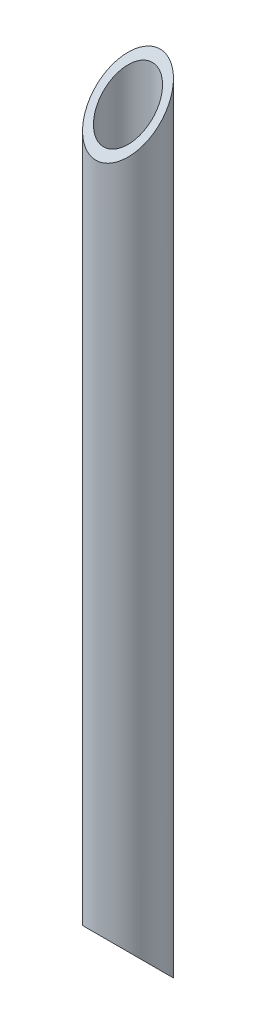
ISO-10303-21;
HEADER;
FILE_DESCRIPTION(('STEP AP214'),'2;1');
FILE_NAME('part.step','',(''),(''),'','','');
FILE_SCHEMA(('AUTOMOTIVE_DESIGN { 1 0 10303 214 1 1 1 1 }'));
ENDSEC;
DATA;
#1=APPLICATION_CONTEXT('core data for automotive mechanical design processes');
#2=APPLICATION_PROTOCOL_DEFINITION('international standard','automotive_design',2000,#1);
#3=PRODUCT_CONTEXT('',#1,'mechanical');
#4=PRODUCT('Part','Part','',(#3));
#5=PRODUCT_RELATED_PRODUCT_CATEGORY('part','',(#4));
#6=PRODUCT_DEFINITION_FORMATION('','',#4);
#7=PRODUCT_DEFINITION_CONTEXT('part definition',#1,'design');
#8=PRODUCT_DEFINITION('design','',#6,#7);
#9=PRODUCT_DEFINITION_SHAPE('','',#8);
#10=(LENGTH_UNIT() NAMED_UNIT(*) SI_UNIT(.MILLI.,.METRE.));
#11=(NAMED_UNIT(*) PLANE_ANGLE_UNIT() SI_UNIT($,.RADIAN.));
#12=(NAMED_UNIT(*) SI_UNIT($,.STERADIAN.) SOLID_ANGLE_UNIT());
#13=UNCERTAINTY_MEASURE_WITH_UNIT(LENGTH_MEASURE(1.E-05),#10,'distance_accuracy_value','');
#14=(GEOMETRIC_REPRESENTATION_CONTEXT(3) GLOBAL_UNCERTAINTY_ASSIGNED_CONTEXT((#13)) GLOBAL_UNIT_ASSIGNED_CONTEXT((#10,
#11,#12)) REPRESENTATION_CONTEXT('',''));
#15=CARTESIAN_POINT('',(0.,0.,0.));
#16=DIRECTION('',(0.,0.,1.));
#17=DIRECTION('',(1.,0.,0.));
#18=AXIS2_PLACEMENT_3D('',#15,#16,#17);
#19=CARTESIAN_POINT('',(2599.99999999996,289.999999999996,-275.000000000001));
#20=DIRECTION('',(0.,-0.999999999999999,0.));
#21=DIRECTION('',(0.,0.,-1.));
#22=AXIS2_PLACEMENT_3D('',#19,#20,#21);
#23=CYLINDRICAL_SURFACE('',#22,9.64999999999982);
#24=CARTESIAN_POINT('',(2599.99999999996,1.94289029309402E-13,-275.000000000001));
#25=DIRECTION('',(0.,0.707106781186547,-0.707106781186548));
#26=DIRECTION('',(0.,-0.707106781186548,-0.707106781186547));
#27=AXIS2_PLACEMENT_3D('',#24,#25,#26);
#28=ELLIPSE('',#27,13.6471608769001,9.64999999999982);
#29=CARTESIAN_POINT('',(2599.99999999996,-9.64999999999963,-284.650000000001));
#30=VERTEX_POINT('',#29);
#31=EDGE_CURVE('E45',#30,#30,#28,.T.);
#32=ORIENTED_EDGE('',*,*,#31,.F.);
#33=EDGE_LOOP('',(#32));
#34=FACE_BOUND('',#33,.T.);
#35=CARTESIAN_POINT('',(2599.99999999996,289.999999999996,-275.000000000001));
#36=DIRECTION('',(0.,-0.707106781186548,-0.707106781186547));
#37=DIRECTION('',(0.,-0.707106781186547,0.707106781186547));
#38=AXIS2_PLACEMENT_3D('',#35,#36,#37);
#39=ELLIPSE('',#38,13.6471608769001,9.64999999999982);
#40=CARTESIAN_POINT('',(2599.99999999996,280.349999999996,-265.350000000001));
#41=VERTEX_POINT('',#40);
#42=EDGE_CURVE('E58',#41,#41,#39,.T.);
#43=ORIENTED_EDGE('',*,*,#42,.F.);
#44=EDGE_LOOP('',(#43));
#45=FACE_BOUND('',#44,.T.);
#46=ADVANCED_FACE('F38',(#34,#45),#23,.F.);
#47=CARTESIAN_POINT('',(2599.99999999996,289.999999999996,-275.000000000001));
#48=DIRECTION('',(0.,-0.707106781186548,-0.707106781186547));
#49=DIRECTION('',(0.,0.707106781186547,-0.707106781186547));
#50=AXIS2_PLACEMENT_3D('',#47,#48,#49);
#51=PLANE('',#50);
#52=ORIENTED_EDGE('',*,*,#42,.T.);
#53=EDGE_LOOP('',(#52));
#54=FACE_BOUND('',#53,.T.);
#55=CARTESIAN_POINT('',(2599.99999999996,289.999999999996,-275.000000000001));
#56=DIRECTION('',(0.,-0.707106781186548,-0.707106781186547));
#57=DIRECTION('',(0.,-0.707106781186547,0.707106781186547));
#58=AXIS2_PLACEMENT_3D('',#55,#56,#57);
#59=ELLIPSE('',#58,17.9605122421381,12.6999999999999);
#60=CARTESIAN_POINT('',(2599.99999999996,277.299999999996,-262.300000000001));
#61=VERTEX_POINT('',#60);
#62=EDGE_CURVE('E51',#61,#61,#59,.T.);
#63=ORIENTED_EDGE('',*,*,#62,.F.);
#64=EDGE_LOOP('',(#63));
#65=FACE_BOUND('',#64,.T.);
#66=ADVANCED_FACE('F65',(#54,#65),#51,.F.);
#67=CARTESIAN_POINT('',(2599.99999999996,289.999999999996,-275.000000000001));
#68=DIRECTION('',(0.,-0.999999999999999,0.));
#69=DIRECTION('',(0.,0.,-1.));
#70=AXIS2_PLACEMENT_3D('',#67,#68,#69);
#71=CYLINDRICAL_SURFACE('',#70,12.6999999999999);
#72=CARTESIAN_POINT('',(2599.99999999996,1.94289029309402E-13,-275.000000000001));
#73=DIRECTION('',(0.,0.707106781186547,-0.707106781186548));
#74=DIRECTION('',(0.,-0.707106781186548,-0.707106781186547));
#75=AXIS2_PLACEMENT_3D('',#72,#73,#74);
#76=ELLIPSE('',#75,17.9605122421381,12.6999999999999);
#77=CARTESIAN_POINT('',(2599.99999999996,-12.6999999999997,-287.700000000001));
#78=VERTEX_POINT('',#77);
#79=EDGE_CURVE('E10',#78,#78,#76,.T.);
#80=ORIENTED_EDGE('',*,*,#79,.T.);
#81=EDGE_LOOP('',(#80));
#82=FACE_BOUND('',#81,.T.);
#83=ORIENTED_EDGE('',*,*,#62,.T.);
#84=EDGE_LOOP('',(#83));
#85=FACE_BOUND('',#84,.T.);
#86=ADVANCED_FACE('F74',(#82,#85),#71,.T.);
#87=CARTESIAN_POINT('',(2599.99999999996,1.38777878078145E-13,-275.000000000001));
#88=DIRECTION('',(0.,0.707106781186547,-0.707106781186548));
#89=DIRECTION('',(0.,0.707106781186548,0.707106781186547));
#90=AXIS2_PLACEMENT_3D('',#87,#88,#89);
#91=PLANE('',#90);
#92=ORIENTED_EDGE('',*,*,#31,.T.);
#93=EDGE_LOOP('',(#92));
#94=FACE_BOUND('',#93,.T.);
#95=ORIENTED_EDGE('',*,*,#79,.F.);
#96=EDGE_LOOP('',(#95));
#97=FACE_BOUND('',#96,.T.);
#98=ADVANCED_FACE('F80',(#94,#97),#91,.F.);
#99=CLOSED_SHELL('',(#46,#66,#86,#98));
#100=MANIFOLD_SOLID_BREP('B2',#99);
#101=ADVANCED_BREP_SHAPE_REPRESENTATION('',(#18,#100),#14);
#102=SHAPE_DEFINITION_REPRESENTATION(#9,#101);
ENDSEC;
END-ISO-10303-21;
